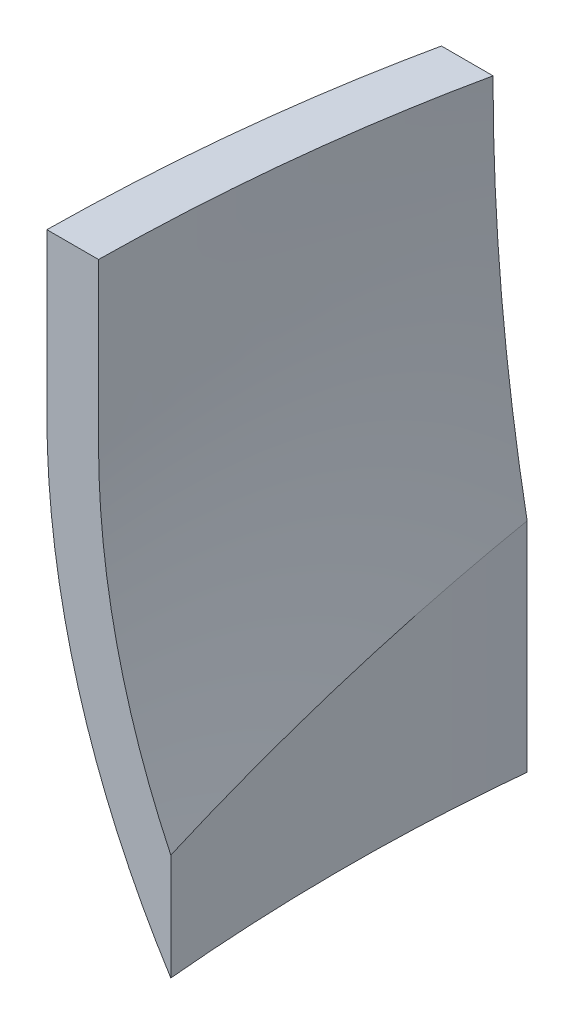
ISO-10303-21;
HEADER;
FILE_DESCRIPTION(('STEP AP214'),'2;1');
FILE_NAME('part.step','',(''),(''),'','','');
FILE_SCHEMA(('AUTOMOTIVE_DESIGN { 1 0 10303 214 1 1 1 1 }'));
ENDSEC;
DATA;
#1=APPLICATION_CONTEXT('core data for automotive mechanical design processes');
#2=APPLICATION_PROTOCOL_DEFINITION('international standard','automotive_design',2000,#1);
#3=PRODUCT_CONTEXT('',#1,'mechanical');
#4=PRODUCT('Part','Part','',(#3));
#5=PRODUCT_RELATED_PRODUCT_CATEGORY('part','',(#4));
#6=PRODUCT_DEFINITION_FORMATION('','',#4);
#7=PRODUCT_DEFINITION_CONTEXT('part definition',#1,'design');
#8=PRODUCT_DEFINITION('design','',#6,#7);
#9=PRODUCT_DEFINITION_SHAPE('','',#8);
#10=(LENGTH_UNIT() NAMED_UNIT(*) SI_UNIT(.MILLI.,.METRE.));
#11=(NAMED_UNIT(*) PLANE_ANGLE_UNIT() SI_UNIT($,.RADIAN.));
#12=(NAMED_UNIT(*) SI_UNIT($,.STERADIAN.) SOLID_ANGLE_UNIT());
#13=UNCERTAINTY_MEASURE_WITH_UNIT(LENGTH_MEASURE(1.E-05),#10,'distance_accuracy_value','');
#14=(GEOMETRIC_REPRESENTATION_CONTEXT(3) GLOBAL_UNCERTAINTY_ASSIGNED_CONTEXT((#13)) GLOBAL_UNIT_ASSIGNED_CONTEXT((#10,
#11,#12)) REPRESENTATION_CONTEXT('',''));
#15=CARTESIAN_POINT('',(0.,0.,0.));
#16=DIRECTION('',(0.,0.,1.));
#17=DIRECTION('',(1.,0.,0.));
#18=AXIS2_PLACEMENT_3D('',#15,#16,#17);
#19=CARTESIAN_POINT('',(293.472310864154,43.37710450171,0.));
#20=DIRECTION('',(0.,0.,1.));
#21=DIRECTION('',(1.,0.,0.));
#22=AXIS2_PLACEMENT_3D('',#19,#20,#21);
#23=PLANE('',#22);
#24=CARTESIAN_POINT('',(293.472310864154,43.37710450171,0.));
#25=DIRECTION('',(0.,0.,-1.));
#26=DIRECTION('',(1.,0.,0.));
#27=AXIS2_PLACEMENT_3D('',#24,#25,#26);
#28=CIRCLE('',#27,382.072310864153);
#29=CARTESIAN_POINT('',(-81.9999999999987,-27.3321205216683,0.));
#30=VERTEX_POINT('',#29);
#31=CARTESIAN_POINT('',(-88.5999999999987,43.3771045017101,0.));
#32=VERTEX_POINT('',#31);
#33=EDGE_CURVE('E266',#30,#32,#28,.T.);
#34=ORIENTED_EDGE('',*,*,#33,.F.);
#35=DIRECTION('',(0.,1.,0.));
#36=VECTOR('',#35,1.);
#37=CARTESIAN_POINT('',(-81.9999999999987,-27.3321205216683,0.));
#38=LINE('',#37,#36);
#39=CARTESIAN_POINT('',(-81.9999999999987,-69.4999999999994,0.));
#40=VERTEX_POINT('',#39);
#41=EDGE_CURVE('E486',#40,#30,#38,.T.);
#42=ORIENTED_EDGE('',*,*,#41,.F.);
#43=CARTESIAN_POINT('',(293.472310864154,43.37710450171,0.));
#44=DIRECTION('',(0.,0.,1.));
#45=DIRECTION('',(1.,0.,0.));
#46=AXIS2_PLACEMENT_3D('',#43,#44,#45);
#47=CIRCLE('',#46,392.072310864153);
#48=CARTESIAN_POINT('',(-98.5999999999987,43.37710450171,0.));
#49=VERTEX_POINT('',#48);
#50=EDGE_CURVE('E204',#49,#40,#47,.T.);
#51=ORIENTED_EDGE('',*,*,#50,.F.);
#52=DIRECTION('',(0.,1.,0.));
#53=VECTOR('',#52,1.);
#54=CARTESIAN_POINT('',(-98.5999999999987,44.0000000000006,0.));
#55=LINE('',#54,#53);
#56=CARTESIAN_POINT('',(-98.5999999999987,44.0000000000006,0.));
#57=VERTEX_POINT('',#56);
#58=EDGE_CURVE('E252',#49,#57,#55,.T.);
#59=ORIENTED_EDGE('',*,*,#58,.T.);
#60=DIRECTION('',(-1.,0.,0.));
#61=VECTOR('',#60,1.);
#62=CARTESIAN_POINT('',(293.472310864154,44.0000000000006,0.));
#63=LINE('',#62,#61);
#64=CARTESIAN_POINT('',(-88.5999999999987,44.0000000000006,0.));
#65=VERTEX_POINT('',#64);
#66=EDGE_CURVE('E188',#65,#57,#63,.T.);
#67=ORIENTED_EDGE('',*,*,#66,.F.);
#68=DIRECTION('',(0.,1.,0.));
#69=VECTOR('',#68,1.);
#70=CARTESIAN_POINT('',(-88.5999999999987,44.0000000000006,0.));
#71=LINE('',#70,#69);
#72=EDGE_CURVE('E15',#32,#65,#71,.T.);
#73=ORIENTED_EDGE('',*,*,#72,.F.);
#74=EDGE_LOOP('',(#34,#42,#51,#59,#67,#73));
#75=FACE_BOUND('',#74,.T.);
#76=ADVANCED_FACE('F177',(#75),#23,.F.);
#77=CARTESIAN_POINT('',(47.7968750004928,13.0000000000125,69.0000000000018));
#78=DIRECTION('',(0.,0.,-1.));
#79=DIRECTION('',(-1.,0.,0.));
#80=AXIS2_PLACEMENT_3D('',#77,#78,#79);
#81=PLANE('',#80);
#82=DIRECTION('',(-4.95750394141011E-12,1.,0.));
#83=VECTOR('',#82,1.);
#84=CARTESIAN_POINT('',(-105.999999999724,43.9999999999975,69.0000000000018));
#85=LINE('',#84,#83);
#86=CARTESIAN_POINT('',(-105.99999999957,12.9999999999975,69.0000000000018));
#87=VERTEX_POINT('',#86);
#88=CARTESIAN_POINT('',(-105.999999999724,43.9999999999975,69.0000000000018));
#89=VERTEX_POINT('',#88);
#90=EDGE_CURVE('E245',#87,#89,#85,.T.);
#91=ORIENTED_EDGE('',*,*,#90,.F.);
#92=CARTESIAN_POINT('',(47.7968750004928,13.0000000000125,69.0000000000018));
#93=DIRECTION('',(0.,0.,-1.));
#94=DIRECTION('',(-1.,0.,0.));
#95=AXIS2_PLACEMENT_3D('',#92,#93,#94);
#96=CIRCLE('',#95,153.796875000062);
#97=CARTESIAN_POINT('',(-81.9999999995703,-69.5000000000042,69.0000000000018));
#98=VERTEX_POINT('',#97);
#99=EDGE_CURVE('E260',#98,#87,#96,.T.);
#100=ORIENTED_EDGE('',*,*,#99,.F.);
#101=DIRECTION('',(2.08087886916519E-11,-1.,0.));
#102=VECTOR('',#101,1.);
#103=CARTESIAN_POINT('',(-81.9999999995699,-69.500000000004,69.0000000000018));
#104=LINE('',#103,#102);
#105=CARTESIAN_POINT('',(-81.9999999999988,-48.8895184978859,69.0000000000018));
#106=VERTEX_POINT('',#105);
#107=EDGE_CURVE('E374',#106,#98,#104,.T.);
#108=ORIENTED_EDGE('',*,*,#107,.F.);
#109=CARTESIAN_POINT('',(47.7968750004928,13.0000000000125,69.0000000000018));
#110=DIRECTION('',(0.,0.,1.));
#111=DIRECTION('',(-1.,0.,0.));
#112=AXIS2_PLACEMENT_3D('',#109,#110,#111);
#113=CIRCLE('',#112,143.796875000277);
#114=CARTESIAN_POINT('',(-95.9999999999453,13.0000000002962,69.0000000000018));
#115=VERTEX_POINT('',#114);
#116=EDGE_CURVE('E365',#115,#106,#113,.T.);
#117=ORIENTED_EDGE('',*,*,#116,.F.);
#118=DIRECTION('',(0.,-1.,0.));
#119=VECTOR('',#118,1.);
#120=CARTESIAN_POINT('',(-95.9999999999987,33.9999999999975,69.0000000000018));
#121=LINE('',#120,#119);
#122=CARTESIAN_POINT('',(-95.9999999999987,33.9999999988572,69.0000000000018));
#123=VERTEX_POINT('',#122);
#124=EDGE_CURVE('E357',#123,#115,#121,.T.);
#125=ORIENTED_EDGE('',*,*,#124,.F.);
#126=DIRECTION('',(0.,-1.,0.));
#127=VECTOR('',#126,1.);
#128=CARTESIAN_POINT('',(-95.9999999999987,43.9999999999975,69.0000000000018));
#129=LINE('',#128,#127);
#130=CARTESIAN_POINT('',(-95.9999999999987,43.9999999999975,69.0000000000018));
#131=VERTEX_POINT('',#130);
#132=EDGE_CURVE('E248',#131,#123,#129,.T.);
#133=ORIENTED_EDGE('',*,*,#132,.F.);
#134=DIRECTION('',(1.,0.,0.));
#135=VECTOR('',#134,1.);
#136=CARTESIAN_POINT('',(47.7968750004928,43.9999999999975,69.0000000000018));
#137=LINE('',#136,#135);
#138=EDGE_CURVE('E241',#89,#131,#137,.T.);
#139=ORIENTED_EDGE('',*,*,#138,.F.);
#140=EDGE_LOOP('',(#91,#100,#108,#117,#125,#133,#139));
#141=FACE_BOUND('',#140,.T.);
#142=ADVANCED_FACE('F243',(#141),#81,.F.);
#143=CARTESIAN_POINT('',(-81.9999999995703,-69.5000000000042,69.0000000000018));
#144=CARTESIAN_POINT('',(-84.1908103200391,-69.5000000000026,45.241721401937));
#145=CARTESIAN_POINT('',(-84.2631564827319,-69.500000000001,22.1008436879174));
#146=CARTESIAN_POINT('',(-81.9999999999987,-69.4999999999994,0.));
#147=CARTESIAN_POINT('',(-85.6689657134802,-63.7276329194251,69.0000000000018));
#148=CARTESIAN_POINT('',(-87.5916872120858,-62.475394429924,45.241721401937));
#149=CARTESIAN_POINT('',(-87.3959445529155,-61.2231559404229,22.1008436879174));
#150=CARTESIAN_POINT('',(-84.8646992483191,-59.9709174509218,0.));
#151=CARTESIAN_POINT('',(-92.199240831058,-51.7628209844033,69.0000000000017));
#152=CARTESIAN_POINT('',(-93.6452289868945,-47.9536031292892,45.241721401937));
#153=CARTESIAN_POINT('',(-92.972752984955,-44.1443852741752,22.1008436879173));
#154=CARTESIAN_POINT('',(-89.9647743375895,-40.3351674190612,0.));
#155=CARTESIAN_POINT('',(-98.4136459689345,-35.6135344487323,69.0000000000018));
#156=CARTESIAN_POINT('',(-99.2499345390836,-28.9519178407417,45.241721401937));
#157=CARTESIAN_POINT('',(-97.9677589514568,-22.290301232751,22.1008436879174));
#158=CARTESIAN_POINT('',(-94.350080718404,-15.6286846247604,0.));
#159=CARTESIAN_POINT('',(-102.141988434971,-21.8056858802479,69.0000000000018));
#160=CARTESIAN_POINT('',(-102.502180392754,-13.3774625341844,45.241721401937));
#161=CARTESIAN_POINT('',(-100.743908192761,-4.94923918812084,22.1008436879174));
#162=CARTESIAN_POINT('',(-96.6501333473424,3.47898415794269,0.));
#163=CARTESIAN_POINT('',(-104.266600538542,-10.9299496511044,69.0000000000018));
#164=CARTESIAN_POINT('',(-104.307266006238,-1.49616436878978,45.241721401937));
#165=CARTESIAN_POINT('',(-102.229467316158,7.93762091352483,22.1008436879173));
#166=CARTESIAN_POINT('',(-97.8161659806517,17.3714061958395,0.));
#167=CARTESIAN_POINT('',(-105.64955206799,0.564216099308913,69.0000000000018));
#168=CARTESIAN_POINT('',(-105.446605423996,10.6147866868206,45.241721401937));
#169=CARTESIAN_POINT('',(-103.125194622225,20.6653572743322,22.1008436879174));
#170=CARTESIAN_POINT('',(-98.4682811750285,30.7159278618439,0.));
#171=CARTESIAN_POINT('',(-105.999999999569,8.74115216883132,69.0000000000018));
#172=CARTESIAN_POINT('',(-105.724143653372,18.9024163664831,45.241721401937));
#173=CARTESIAN_POINT('',(-103.329823149398,29.0636805641349,22.1008436879174));
#174=CARTESIAN_POINT('',(-98.5999999999987,39.2249447617867,0.));
#175=CARTESIAN_POINT('',(-105.99999999957,13.0413180863678,69.0000000000018));
#176=CARTESIAN_POINT('',(-105.724143653372,23.1666745680337,45.241721401937));
#177=CARTESIAN_POINT('',(-103.329823149399,33.2920310496997,22.1008436879174));
#178=CARTESIAN_POINT('',(-98.5999999999987,43.4173875313656,0.));
#179=CARTESIAN_POINT('',(-105.99999999957,13.1037546215268,69.0000000000018));
#180=CARTESIAN_POINT('',(-105.724143653372,23.1964742197901,45.241721401937));
#181=CARTESIAN_POINT('',(-103.329823149399,33.2891938180534,22.1008436879174));
#182=CARTESIAN_POINT('',(-98.5999999999987,43.3819134163167,0.));
#183=CARTESIAN_POINT('',(-105.999999999571,13.1774382592689,69.0000000000018));
#184=CARTESIAN_POINT('',(-105.724143653373,23.2596541388195,45.241721401937));
#185=CARTESIAN_POINT('',(-103.329823149399,33.3418700183701,22.1008436879174));
#186=CARTESIAN_POINT('',(-98.5999999999987,43.4240858979207,0.));
#187=CARTESIAN_POINT('',(-105.999999999571,13.2144949631804,69.0000000000018));
#188=CARTESIAN_POINT('',(-105.724143653373,23.2798616774904,45.241721401937));
#189=CARTESIAN_POINT('',(-103.329823149399,33.3452283918004,22.1008436879174));
#190=CARTESIAN_POINT('',(-98.5999999999987,43.4105951061104,0.));
#191=CARTESIAN_POINT('',(-105.999999999571,13.2357322799548,69.0000000000018));
#192=CARTESIAN_POINT('',(-105.724143653373,23.2974803503089,45.241721401937));
#193=CARTESIAN_POINT('',(-103.329823149399,33.3592284206629,22.1008436879174));
#194=CARTESIAN_POINT('',(-98.5999999999987,43.420976491017,0.));
#195=CARTESIAN_POINT('',(-105.999999999571,13.2676506433478,69.0000000000018));
#196=CARTESIAN_POINT('',(-105.724143653373,23.3180724300584,45.241721401937));
#197=CARTESIAN_POINT('',(-103.329823149399,33.368494216769,22.1008436879174));
#198=CARTESIAN_POINT('',(-98.5999999999987,43.4189160034795,0.));
#199=CARTESIAN_POINT('',(-105.999999999571,13.3157633849377,69.0000000000018));
#200=CARTESIAN_POINT('',(-105.724143653373,23.3531664944067,45.241721401937));
#201=CARTESIAN_POINT('',(-103.329823149399,33.3905696038758,22.1008436879174));
#202=CARTESIAN_POINT('',(-98.5999999999987,43.4279727133449,0.));
#203=CARTESIAN_POINT('',(-105.999999999572,13.3696489360882,69.0000000000018));
#204=CARTESIAN_POINT('',(-105.724143653373,23.3895453193955,45.241721401937));
#205=CARTESIAN_POINT('',(-103.329823149399,33.4094417027027,22.1008436879174));
#206=CARTESIAN_POINT('',(-98.5999999999988,43.42933808601,0.));
#207=CARTESIAN_POINT('',(-105.999999999572,13.4130188400023,69.0000000000018));
#208=CARTESIAN_POINT('',(-105.724143653373,23.4199750379318,45.241721401937));
#209=CARTESIAN_POINT('',(-103.329823149399,33.4269312358612,22.1008436879173));
#210=CARTESIAN_POINT('',(-98.5999999999986,43.4338874337907,0.));
#211=CARTESIAN_POINT('',(-105.999999999572,13.4456783227756,69.0000000000018));
#212=CARTESIAN_POINT('',(-105.724143653374,23.4423541082036,45.241721401937));
#213=CARTESIAN_POINT('',(-103.329823149399,33.4390298936316,22.1008436879173));
#214=CARTESIAN_POINT('',(-98.5999999999988,43.4357056790597,0.));
#215=CARTESIAN_POINT('',(-105.999999999572,13.4784711837275,69.0000000000018));
#216=CARTESIAN_POINT('',(-105.724143653374,23.4650625139528,45.241721401937));
#217=CARTESIAN_POINT('',(-103.329823149399,33.4516538441781,22.1008436879173));
#218=CARTESIAN_POINT('',(-98.5999999999985,43.4382451744033,0.));
#219=CARTESIAN_POINT('',(-105.999999999572,13.5031668555812,69.0000000000018));
#220=CARTESIAN_POINT('',(-105.724143653374,23.4820301354838,45.241721401937));
#221=CARTESIAN_POINT('',(-103.329823149399,33.4608934153863,22.1008436879173));
#222=CARTESIAN_POINT('',(-98.5999999999989,43.4397566952889,0.));
#223=CARTESIAN_POINT('',(-105.999999999572,13.519673144586,69.0000000000018));
#224=CARTESIAN_POINT('',(-105.724143653374,23.493424509904,45.241721401937));
#225=CARTESIAN_POINT('',(-103.329823149399,33.467175875222,22.1008436879173));
#226=CARTESIAN_POINT('',(-98.5999999999986,43.44092724054,0.));
#227=CARTESIAN_POINT('',(-105.999999999572,13.5279348113194,69.0000000000018));
#228=CARTESIAN_POINT('',(-105.724143653374,23.4990986055526,45.241721401937));
#229=CARTESIAN_POINT('',(-103.329823149399,33.4702623997859,22.1008436879173));
#230=CARTESIAN_POINT('',(-98.5999999999987,43.4414261940192,0.));
#231=CARTESIAN_POINT('',(-105.999999999572,13.5362050209609,69.0000000000018));
#232=CARTESIAN_POINT('',(-105.724143653374,23.5047997287603,45.241721401937));
#233=CARTESIAN_POINT('',(-103.329823149399,33.4733944365596,22.1008436879173));
#234=CARTESIAN_POINT('',(-98.5999999999987,43.4419891443589,0.));
#235=CARTESIAN_POINT('',(-105.999999999573,13.5444837941878,69.0000000000018));
#236=CARTESIAN_POINT('',(-105.724143653374,23.5104922178391,45.241721401937));
#237=CARTESIAN_POINT('',(-103.329823149399,33.4765006414904,22.1008436879173));
#238=CARTESIAN_POINT('',(-98.5999999999988,43.4425090651417,0.));
#239=CARTESIAN_POINT('',(-105.999999999573,13.5527711516773,69.0000000000018));
#240=CARTESIAN_POINT('',(-105.724143653374,23.5161964206278,45.241721401937));
#241=CARTESIAN_POINT('',(-103.329823149399,33.4796216895783,22.1008436879173));
#242=CARTESIAN_POINT('',(-98.5999999999986,43.4430469585288,0.));
#243=CARTESIAN_POINT('',(-105.999999999573,13.5610671141064,69.0000000000018));
#244=CARTESIAN_POINT('',(-105.724143653374,23.5219013306976,45.241721401937));
#245=CARTESIAN_POINT('',(-103.329823149399,33.4827355472887,22.1008436879173));
#246=CARTESIAN_POINT('',(-98.5999999999989,43.4435697638799,0.));
#247=CARTESIAN_POINT('',(-105.999999999573,13.5693717021524,69.0000000000018));
#248=CARTESIAN_POINT('',(-105.724143653374,23.527612936301,45.241721401937));
#249=CARTESIAN_POINT('',(-103.329823149399,33.4858541704495,22.1008436879174));
#250=CARTESIAN_POINT('',(-98.5999999999986,43.444095404598,0.));
#251=CARTESIAN_POINT('',(-105.999999999573,13.5776849364926,69.0000000000018));
#252=CARTESIAN_POINT('',(-105.724143653374,23.5333280781905,45.241721401937));
#253=CARTESIAN_POINT('',(-103.329823149399,33.4889712198883,22.1008436879174));
#254=CARTESIAN_POINT('',(-98.5999999999987,43.4446143615862,0.));
#255=CARTESIAN_POINT('',(-105.999999999573,13.5860068378042,69.0000000000018));
#256=CARTESIAN_POINT('',(-105.724143653374,23.5390485101105,45.241721401937));
#257=CARTESIAN_POINT('',(-103.329823149399,33.4920901824168,22.1008436879174));
#258=CARTESIAN_POINT('',(-98.5999999999987,43.4451318547231,0.));
#259=CARTESIAN_POINT('',(-105.999999999573,13.5943374267644,69.0000000000018));
#260=CARTESIAN_POINT('',(-105.724143653374,23.5447733470122,45.241721401937));
#261=CARTESIAN_POINT('',(-103.329823149399,33.4952092672601,22.1008436879174));
#262=CARTESIAN_POINT('',(-98.5999999999986,43.445645187508,0.));
#263=CARTESIAN_POINT('',(-105.999999999573,13.6026767240503,69.0000000000018));
#264=CARTESIAN_POINT('',(-105.724143653374,23.5505031179613,45.241721401937));
#265=CARTESIAN_POINT('',(-103.3298231494,33.4983295118723,22.1008436879174));
#266=CARTESIAN_POINT('',(-98.5999999999988,43.4461559057834,0.));
#267=CARTESIAN_POINT('',(-105.999999999573,13.6110247503395,69.0000000000018));
#268=CARTESIAN_POINT('',(-105.724143653374,23.5562375945782,45.241721401937));
#269=CARTESIAN_POINT('',(-103.329823149399,33.501450438817,22.1008436879174));
#270=CARTESIAN_POINT('',(-98.5999999999986,43.4466632830557,0.));
#271=CARTESIAN_POINT('',(-105.999999999573,13.6193815263089,69.0000000000018));
#272=CARTESIAN_POINT('',(-105.724143653374,23.5619769487229,45.241721401937));
#273=CARTESIAN_POINT('',(-103.3298231494,33.5045723711369,22.1008436879174));
#274=CARTESIAN_POINT('',(-98.5999999999988,43.4471677935509,0.));
#275=CARTESIAN_POINT('',(-105.999999999573,13.6305355880779,69.0000000000018));
#276=CARTESIAN_POINT('',(-105.724143653374,23.5696358780609,45.241721401937));
#277=CARTESIAN_POINT('',(-103.329823149399,33.5087361680439,22.1008436879174));
#278=CARTESIAN_POINT('',(-98.5999999999986,43.4478364580269,0.));
#279=CARTESIAN_POINT('',(-105.999999999573,13.641707231916,69.0000000000018));
#280=CARTESIAN_POINT('',(-105.724143653374,23.5773046146135,45.241721401937));
#281=CARTESIAN_POINT('',(-103.3298231494,33.512901997311,22.1008436879174));
#282=CARTESIAN_POINT('',(-98.5999999999988,43.4484993800084,0.));
#283=CARTESIAN_POINT('',(-105.999999999573,13.6528965405322,69.0000000000018));
#284=CARTESIAN_POINT('',(-105.724143653374,23.5849832654169,45.241721401937));
#285=CARTESIAN_POINT('',(-103.3298231494,33.5170699903017,22.1008436879174));
#286=CARTESIAN_POINT('',(-98.5999999999987,43.4491567151864,0.));
#287=CARTESIAN_POINT('',(-105.999999999573,13.6612973750605,69.0000000000018));
#288=CARTESIAN_POINT('',(-105.724143653374,23.5907472485892,45.241721401937));
#289=CARTESIAN_POINT('',(-103.3298231494,33.5201971221179,22.1008436879174));
#290=CARTESIAN_POINT('',(-98.5999999999989,43.4496469956466,0.));
#291=CARTESIAN_POINT('',(-105.999999999573,13.6697070833322,69.0000000000018));
#292=CARTESIAN_POINT('',(-105.724143653374,23.5965162521717,45.241721401937));
#293=CARTESIAN_POINT('',(-103.329823149399,33.5233254210113,22.1008436879174));
#294=CARTESIAN_POINT('',(-98.5999999999985,43.4501345898509,0.));
#295=CARTESIAN_POINT('',(-105.999999999573,13.6781256860245,69.0000000000018));
#296=CARTESIAN_POINT('',(-105.724143653374,23.6022903092631,45.241721401937));
#297=CARTESIAN_POINT('',(-103.3298231494,33.5264549325018,22.1008436879173));
#298=CARTESIAN_POINT('',(-98.5999999999989,43.4506195557404,0.));
#299=CARTESIAN_POINT('',(-105.999999999573,13.6865532038145,69.0000000000018));
#300=CARTESIAN_POINT('',(-105.724143653374,23.608069447825,45.241721401937));
#301=CARTESIAN_POINT('',(-103.3298231494,33.5295856918354,22.1008436879173));
#302=CARTESIAN_POINT('',(-98.5999999999987,43.4511019358458,0.));
#303=CARTESIAN_POINT('',(-105.999999999573,13.6949896573794,69.0000000000018));
#304=CARTESIAN_POINT('',(-105.724143653374,23.6138536976359,45.241721401937));
#305=CARTESIAN_POINT('',(-103.3298231494,33.5327177378924,22.1008436879173));
#306=CARTESIAN_POINT('',(-98.5999999999987,43.4515817781489,0.));
#307=CARTESIAN_POINT('',(-105.999999999573,13.7034350673964,69.0000000000018));
#308=CARTESIAN_POINT('',(-105.724143653374,23.6196430873025,45.241721401937));
#309=CARTESIAN_POINT('',(-103.3298231494,33.5358511072087,22.1008436879173));
#310=CARTESIAN_POINT('',(-98.5999999999987,43.4520591271148,0.));
#311=CARTESIAN_POINT('',(-105.999999999573,13.7118894545428,69.0000000000018));
#312=CARTESIAN_POINT('',(-105.724143653374,23.6254376444716,45.241721401937));
#313=CARTESIAN_POINT('',(-103.3298231494,33.5389858344003,22.1008436879173));
#314=CARTESIAN_POINT('',(-98.5999999999988,43.452534024329,0.));
#315=CARTESIAN_POINT('',(-105.999999999573,13.7203528394958,69.0000000000018));
#316=CARTESIAN_POINT('',(-105.724143653374,23.6312373983481,45.241721401937));
#317=CARTESIAN_POINT('',(-103.3298231494,33.5421219572004,22.1008436879173));
#318=CARTESIAN_POINT('',(-98.5999999999987,43.4530065160528,0.));
#319=CARTESIAN_POINT('',(-105.999999999573,13.7316493774117,69.0000000000017));
#320=CARTESIAN_POINT('',(-105.724143653375,23.6389773658781,45.241721401937));
#321=CARTESIAN_POINT('',(-103.3298231494,33.5463053543446,22.1008436879173));
#322=CARTESIAN_POINT('',(-98.5999999999988,43.4536333428111,0.));
#323=CARTESIAN_POINT('',(-105.999999999574,13.7514499558281,69.0000000000018));
#324=CARTESIAN_POINT('',(-105.724143653375,23.652540689064,45.241721401937));
#325=CARTESIAN_POINT('',(-103.3298231494,33.5536314223,22.1008436879173));
#326=CARTESIAN_POINT('',(-98.5999999999987,43.4547221555359,0.));
#327=CARTESIAN_POINT('',(-105.999999999574,13.7911782398767,69.0000000000018));
#328=CARTESIAN_POINT('',(-105.724143653375,23.6797415734216,45.241721401937));
#329=CARTESIAN_POINT('',(-103.3298231494,33.5683049069666,22.1008436879173));
#330=CARTESIAN_POINT('',(-98.5999999999987,43.4568682405115,0.));
#331=CARTESIAN_POINT('',(-105.999999999574,13.8482994603429,69.0000000000018));
#332=CARTESIAN_POINT('',(-105.724143653375,23.7188162472444,45.241721401937));
#333=CARTESIAN_POINT('',(-103.3298231494,33.589333034146,22.1008436879173));
#334=CARTESIAN_POINT('',(-98.5999999999989,43.4598498210475,0.));
#335=CARTESIAN_POINT('',(-105.999999999574,13.9059182083724,69.0000000000018));
#336=CARTESIAN_POINT('',(-105.724143653375,23.7581894573905,45.241721401937));
#337=CARTESIAN_POINT('',(-103.3298231494,33.6104607064085,22.1008436879173));
#338=CARTESIAN_POINT('',(-98.5999999999985,43.4627319554265,0.));
#339=CARTESIAN_POINT('',(-105.999999999575,13.9523170166975,69.0000000000018));
#340=CARTESIAN_POINT('',(-105.724143653375,23.7898727886284,45.241721401937));
#341=CARTESIAN_POINT('',(-103.3298231494,33.6274285605593,22.1008436879173));
#342=CARTESIAN_POINT('',(-98.5999999999989,43.4649843324903,0.));
#343=CARTESIAN_POINT('',(-105.999999999575,13.9814439621434,69.0000000000018));
#344=CARTESIAN_POINT('',(-105.724143653375,23.8097529655777,45.241721401937));
#345=CARTESIAN_POINT('',(-103.3298231494,33.6380619690119,22.1008436879173));
#346=CARTESIAN_POINT('',(-98.5999999999986,43.4663709724461,0.));
#347=CARTESIAN_POINT('',(-105.999999999575,14.0048227943164,69.0000000000018));
#348=CARTESIAN_POINT('',(-105.724143653375,23.8257046230106,45.241721401937));
#349=CARTESIAN_POINT('',(-103.3298231494,33.6465864517048,22.1008436879173));
#350=CARTESIAN_POINT('',(-98.5999999999987,43.4674682803991,0.));
#351=CARTESIAN_POINT('',(-105.999999999575,14.0282533642572,69.0000000000018));
#352=CARTESIAN_POINT('',(-105.724143653376,23.8416881670366,45.241721401937));
#353=CARTESIAN_POINT('',(-103.3298231494,33.6551229698161,22.1008436879173));
#354=CARTESIAN_POINT('',(-98.5999999999988,43.4685577725956,0.));
#355=CARTESIAN_POINT('',(-105.999999999575,14.0517618716849,69.0000000000018));
#356=CARTESIAN_POINT('',(-105.724143653376,23.8577198627518,45.241721401937));
#357=CARTESIAN_POINT('',(-103.3298231494,33.6636778538187,22.1008436879173));
#358=CARTESIAN_POINT('',(-98.5999999999986,43.4696358448856,0.));
#359=CARTESIAN_POINT('',(-105.999999999575,14.0753489782697,69.0000000000018));
#360=CARTESIAN_POINT('',(-105.724143653376,23.8738003296083,45.241721401937));
#361=CARTESIAN_POINT('',(-103.3298231494,33.6722516809468,22.1008436879173));
#362=CARTESIAN_POINT('',(-98.5999999999988,43.4707030322854,0.));
#363=CARTESIAN_POINT('',(-105.999999999575,14.0989887048492,69.0000000000017));
#364=CARTESIAN_POINT('',(-105.724143653376,23.8899135158771,45.241721401937));
#365=CARTESIAN_POINT('',(-103.3298231494,33.6808383269049,22.1008436879173));
#366=CARTESIAN_POINT('',(-98.5999999999986,43.4717631379328,0.));
#367=CARTESIAN_POINT('',(-105.999999999575,14.1227076922559,69.0000000000017));
#368=CARTESIAN_POINT('',(-105.724143653376,23.9060760795153,45.241721401937));
#369=CARTESIAN_POINT('',(-103.3298231494,33.6894444667746,22.1008436879173));
#370=CARTESIAN_POINT('',(-98.5999999999989,43.472812854034,0.));
#371=CARTESIAN_POINT('',(-105.999999999576,14.1465066021606,69.0000000000017));
#372=CARTESIAN_POINT('',(-105.724143653376,23.922288625378,45.241721401937));
#373=CARTESIAN_POINT('',(-103.3298231494,33.6980706485954,22.1008436879173));
#374=CARTESIAN_POINT('',(-98.5999999999986,43.4738526718128,0.));
#375=CARTESIAN_POINT('',(-105.999999999576,14.1643959112559,69.0000000000017));
#376=CARTESIAN_POINT('',(-105.724143653376,23.9344731610669,45.241721401937));
#377=CARTESIAN_POINT('',(-103.3298231494,33.7045504108778,22.1008436879173));
#378=CARTESIAN_POINT('',(-98.5999999999988,43.4746276606888,0.));
#379=CARTESIAN_POINT('',(-105.999999999576,14.1823255124356,69.0000000000017));
#380=CARTESIAN_POINT('',(-105.724143653376,23.9466829929436,45.241721401937));
#381=CARTESIAN_POINT('',(-103.3298231494,33.7110404734517,22.1008436879173));
#382=CARTESIAN_POINT('',(-98.5999999999986,43.4753979539597,0.));
#383=CARTESIAN_POINT('',(-105.999999999576,14.2422257080401,69.0000000000017));
#384=CARTESIAN_POINT('',(-105.724143653376,23.9874671233468,45.241721401937));
#385=CARTESIAN_POINT('',(-103.329823149401,33.7327085386535,22.1008436879173));
#386=CARTESIAN_POINT('',(-98.5999999999989,43.4779499539602,0.));
#387=CARTESIAN_POINT('',(-105.999999999576,14.3450919250128,69.0000000000017));
#388=CARTESIAN_POINT('',(-105.724143653376,24.0574523160377,45.241721401937));
#389=CARTESIAN_POINT('',(-103.3298231494,33.7698127070625,22.1008436879173));
#390=CARTESIAN_POINT('',(-98.5999999999984,43.4821730980873,0.));
#391=CARTESIAN_POINT('',(-105.999999999577,14.4929993802202,69.0000000000017));
#392=CARTESIAN_POINT('',(-105.724143653377,24.1579625560638,45.241721401937));
#393=CARTESIAN_POINT('',(-103.329823149401,33.8229257319073,22.1008436879173));
#394=CARTESIAN_POINT('',(-98.5999999999991,43.4878889077509,0.));
#395=CARTESIAN_POINT('',(-105.999999999578,14.6436760899007,69.0000000000017));
#396=CARTESIAN_POINT('',(-105.724143653377,24.2602481412049,45.241721401937));
#397=CARTESIAN_POINT('',(-103.329823149401,33.8768201925091,22.1008436879173));
#398=CARTESIAN_POINT('',(-98.5999999999984,43.4933922438133,0.));
#399=CARTESIAN_POINT('',(-105.999999999579,14.7972067478699,69.0000000000017));
#400=CARTESIAN_POINT('',(-105.724143653378,24.3643744970344,45.241721401937));
#401=CARTESIAN_POINT('',(-103.329823149402,33.9315422461988,22.1008436879173));
#402=CARTESIAN_POINT('',(-98.5999999999991,43.4987099953633,0.));
#403=CARTESIAN_POINT('',(-105.99999999958,14.9536760479435,69.0000000000017));
#404=CARTESIAN_POINT('',(-105.724143653378,24.470405358764,45.241721401937));
#405=CARTESIAN_POINT('',(-103.329823149402,33.9871346695846,22.1008436879173));
#406=CARTESIAN_POINT('',(-98.5999999999986,43.5038639804051,0.));
#407=CARTESIAN_POINT('',(-105.99999999958,15.1131686839368,69.0000000000017));
#408=CARTESIAN_POINT('',(-105.724143653379,24.578403248305,45.241721401937));
#409=CARTESIAN_POINT('',(-103.329823149402,34.0436378126732,22.1008436879173));
#410=CARTESIAN_POINT('',(-98.5999999999988,43.5088723770415,0.));
#411=CARTESIAN_POINT('',(-105.999999999581,15.3299695715743,69.0000000000017));
#412=CARTESIAN_POINT('',(-105.72414365338,24.725105023834,45.241721401937));
#413=CARTESIAN_POINT('',(-103.329823149402,34.1202404760936,22.1008436879173));
#414=CARTESIAN_POINT('',(-98.5999999999987,43.5153759283533,0.));
#415=CARTESIAN_POINT('',(-105.999999999583,15.6089524899966,69.0000000000017));
#416=CARTESIAN_POINT('',(-105.724143653381,24.9137055455494,45.241721401937));
#417=CARTESIAN_POINT('',(-103.329823149403,34.2184586011021,22.1008436879173));
#418=CARTESIAN_POINT('',(-98.5999999999986,43.5232116566548,0.));
#419=CARTESIAN_POINT('',(-105.999999999585,16.0732564191035,69.0000000000017));
#420=CARTESIAN_POINT('',(-105.724143653382,25.2272482424501,45.241721401937));
#421=CARTESIAN_POINT('',(-103.329823149404,34.3812400657967,22.1008436879173));
#422=CARTESIAN_POINT('',(-98.5999999999989,43.5352318891433,0.));
#423=CARTESIAN_POINT('',(-105.999999999588,16.6889513186028,69.0000000000017));
#424=CARTESIAN_POINT('',(-105.724143653384,25.6424480853369,45.241721401937));
#425=CARTESIAN_POINT('',(-103.329823149405,34.595944852071,22.1008436879173));
#426=CARTESIAN_POINT('',(-98.5999999999986,43.5494416188051,0.));
#427=CARTESIAN_POINT('',(-105.999999999592,17.4897095831704,69.0000000000017));
#428=CARTESIAN_POINT('',(-105.724143653387,26.1816573581205,45.241721401937));
#429=CARTESIAN_POINT('',(-103.329823149406,34.8736051330707,22.1008436879173));
#430=CARTESIAN_POINT('',(-98.5999999999987,43.5655529080208,0.));
#431=CARTESIAN_POINT('',(-105.999999999598,18.6471803217289,69.0000000000017));
#432=CARTESIAN_POINT('',(-105.724143653391,26.9601372007728,45.241721401937));
#433=CARTESIAN_POINT('',(-103.329823149408,35.2730940798166,22.1008436879173));
#434=CARTESIAN_POINT('',(-98.5999999999988,43.5860509588604,0.));
#435=CARTESIAN_POINT('',(-105.999999999606,20.2759317287628,69.0000000000018));
#436=CARTESIAN_POINT('',(-105.724143653396,28.0540557366024,45.241721401937));
#437=CARTESIAN_POINT('',(-103.32982314941,35.832179744442,22.1008436879173));
#438=CARTESIAN_POINT('',(-98.5999999999986,43.6103037522816,0.));
#439=CARTESIAN_POINT('',(-105.99999999962,23.1679685287858,69.0000000000018));
#440=CARTESIAN_POINT('',(-105.724143653406,29.9943981261083,45.241721401937));
#441=CARTESIAN_POINT('',(-103.329823149415,36.8208277234308,22.1008436879174));
#442=CARTESIAN_POINT('',(-98.5999999999989,43.6472573207533,0.));
#443=CARTESIAN_POINT('',(-105.999999999636,26.3359874268429,69.0000000000018));
#444=CARTESIAN_POINT('',(-105.724143653416,32.1182194450981,45.241721401937));
#445=CARTESIAN_POINT('',(-103.32982314942,37.9004514633534,22.1008436879174));
#446=CARTESIAN_POINT('',(-98.5999999999986,43.6826834816088,0.));
#447=CARTESIAN_POINT('',(-105.999999999651,29.4738489726947,69.0000000000018));
#448=CARTESIAN_POINT('',(-105.724143653426,34.2219110256519,45.241721401937));
#449=CARTESIAN_POINT('',(-103.329823149426,38.9699730786091,22.1008436879174));
#450=CARTESIAN_POINT('',(-98.5999999999987,43.7180351315664,0.));
#451=CARTESIAN_POINT('',(-105.999999999663,31.7976054677814,69.0000000000018));
#452=CARTESIAN_POINT('',(-105.724143653434,35.7800954725539,45.241721401937));
#453=CARTESIAN_POINT('',(-103.32982314943,39.7625854773264,22.1008436879174));
#454=CARTESIAN_POINT('',(-98.5999999999987,43.7450754820989,0.));
#455=CARTESIAN_POINT('',(-105.999999999674,34.077161310367,69.0000000000018));
#456=CARTESIAN_POINT('',(-105.724143653442,37.3089590930562,45.241721401937));
#457=CARTESIAN_POINT('',(-103.329823149433,40.5407568757454,22.1008436879174));
#458=CARTESIAN_POINT('',(-98.5999999999987,43.7725546584345,0.));
#459=CARTESIAN_POINT('',(-105.999999999685,36.2979555122519,69.0000000000018));
#460=CARTESIAN_POINT('',(-105.724143653449,38.7993325384986,45.241721401937));
#461=CARTESIAN_POINT('',(-103.329823149437,41.3007095647452,22.1008436879174));
#462=CARTESIAN_POINT('',(-98.5999999999988,43.8020865909919,0.));
#463=CARTESIAN_POINT('',(-105.999999999696,38.4454270852369,69.0000000000018));
#464=CARTESIAN_POINT('',(-105.724143653456,40.2411238866728,45.241721401937));
#465=CARTESIAN_POINT('',(-103.329823149441,42.0368206881086,22.1008436879174));
#466=CARTESIAN_POINT('',(-98.5999999999988,43.8325174895445,0.));
#467=CARTESIAN_POINT('',(-105.999999999704,40.1398466017157,69.0000000000018));
#468=CARTESIAN_POINT('',(-105.724143653462,41.3808766812368,45.241721401937));
#469=CARTESIAN_POINT('',(-103.329823149443,42.6219067607578,22.1008436879174));
#470=CARTESIAN_POINT('',(-98.5999999999986,43.8629368402789,0.));
#471=CARTESIAN_POINT('',(-105.999999999711,41.4178753761382,69.0000000000018));
#472=CARTESIAN_POINT('',(-105.724143653466,42.2411688662112,45.241721401937));
#473=CARTESIAN_POINT('',(-103.329823149445,43.0644623562842,22.1008436879174));
#474=CARTESIAN_POINT('',(-98.5999999999988,43.8877558463572,0.));
#475=CARTESIAN_POINT('',(-105.999999999715,42.3325378470361,69.0000000000018));
#476=CARTESIAN_POINT('',(-105.724143653469,42.8599878941579,45.241721401937));
#477=CARTESIAN_POINT('',(-103.329823149447,43.3874379412796,22.1008436879174));
#478=CARTESIAN_POINT('',(-98.5999999999986,43.9148879884014,0.));
#479=CARTESIAN_POINT('',(-105.999999999719,43.0539525724028,69.0000000000018));
#480=CARTESIAN_POINT('',(-105.724143653471,43.3460832624638,45.241721401937));
#481=CARTESIAN_POINT('',(-103.329823149448,43.6382139525248,22.1008436879174));
#482=CARTESIAN_POINT('',(-98.5999999999987,43.9303446425859,0.));
#483=CARTESIAN_POINT('',(-105.999999999722,43.604049107198,69.0000000000018));
#484=CARTESIAN_POINT('',(-105.724143653473,43.7258494599349,45.241721401937));
#485=CARTESIAN_POINT('',(-103.329823149449,43.8476498126718,22.1008436879174));
#486=CARTESIAN_POINT('',(-98.5999999999987,43.9694501654088,0.));
#487=CARTESIAN_POINT('',(-105.999999999723,43.8696601518848,69.0000000000018));
#488=CARTESIAN_POINT('',(-105.724143653474,43.901849966413,45.241721401937));
#489=CARTESIAN_POINT('',(-103.329823149449,43.9340397809412,22.1008436879174));
#490=CARTESIAN_POINT('',(-98.5999999999987,43.9662295954695,0.));
#491=CARTESIAN_POINT('',(-105.999999999724,43.9999999999975,69.0000000000018));
#492=CARTESIAN_POINT('',(-105.724143653475,43.9999999999985,45.241721401937));
#493=CARTESIAN_POINT('',(-103.32982314945,43.9999999999995,22.1008436879174));
#494=CARTESIAN_POINT('',(-98.5999999999987,44.0000000000006,0.));
#495=B_SPLINE_SURFACE_WITH_KNOTS('',3,3,((#143,#144,#145,#146),(#147,#148,#149,#150),(#151,#152,
#153,#154),(#155,#156,#157,#158),(#159,#160,#161,#162),(#163,#164,#165,#166),(#167,#168,#169,
#170),(#171,#172,#173,#174),(#175,#176,#177,#178),(#179,#180,#181,#182),(#183,#184,#185,#186),
(#187,#188,#189,#190),(#191,#192,#193,#194),(#195,#196,#197,#198),(#199,#200,#201,#202),(#203,
#204,#205,#206),(#207,#208,#209,#210),(#211,#212,#213,#214),(#215,#216,#217,#218),(#219,#220,
#221,#222),(#223,#224,#225,#226),(#227,#228,#229,#230),(#231,#232,#233,#234),(#235,#236,#237,
#238),(#239,#240,#241,#242),(#243,#244,#245,#246),(#247,#248,#249,#250),(#251,#252,#253,#254),
(#255,#256,#257,#258),(#259,#260,#261,#262),(#263,#264,#265,#266),(#267,#268,#269,#270),(#271,
#272,#273,#274),(#275,#276,#277,#278),(#279,#280,#281,#282),(#283,#284,#285,#286),(#287,#288,
#289,#290),(#291,#292,#293,#294),(#295,#296,#297,#298),(#299,#300,#301,#302),(#303,#304,#305,
#306),(#307,#308,#309,#310),(#311,#312,#313,#314),(#315,#316,#317,#318),(#319,#320,#321,#322),
(#323,#324,#325,#326),(#327,#328,#329,#330),(#331,#332,#333,#334),(#335,#336,#337,#338),(#339,
#340,#341,#342),(#343,#344,#345,#346),(#347,#348,#349,#350),(#351,#352,#353,#354),(#355,#356,
#357,#358),(#359,#360,#361,#362),(#363,#364,#365,#366),(#367,#368,#369,#370),(#371,#372,#373,
#374),(#375,#376,#377,#378),(#379,#380,#381,#382),(#383,#384,#385,#386),(#387,#388,#389,#390),
(#391,#392,#393,#394),(#395,#396,#397,#398),(#399,#400,#401,#402),(#403,#404,#405,#406),(#407,
#408,#409,#410),(#411,#412,#413,#414),(#415,#416,#417,#418),(#419,#420,#421,#422),(#423,#424,
#425,#426),(#427,#428,#429,#430),(#431,#432,#433,#434),(#435,#436,#437,#438),(#439,#440,#441,
#442),(#443,#444,#445,#446),(#447,#448,#449,#450),(#451,#452,#453,#454),(#455,#456,#457,#458),
(#459,#460,#461,#462),(#463,#464,#465,#466),(#467,#468,#469,#470),(#471,#472,#473,#474),(#475,
#476,#477,#478),(#479,#480,#481,#482),(#483,#484,#485,#486),(#487,#488,#489,#490),(#491,#492,
#493,#494)),.UNSPECIFIED.,.F.,.F.,.F.,(4,1,1,1,1,1,2,1,1,1,1,1,1,1,1,1,1,1,1,1,1,1,1,1,1,1,1,1,
1,1,1,1,1,1,1,1,1,1,1,1,1,1,1,1,1,1,1,1,1,1,1,1,1,1,1,1,1,1,1,1,1,1,1,1,1,1,1,1,1,1,1,1,1,1,1,1,
1,1,1,1,1,1,1,1,4),(4,4),(0.516899655829828,0.621446257085651,0.725992858341474,
0.778266158969385,0.830539459597297,0.882812760225208,0.93508606085312,0.935593201002704,
0.935846771077496,0.935973556114892,0.93603694863359,0.936100341152288,0.936353911227081,
0.936607481301873,0.936734266339271,0.936861051376666,0.936987836414061,0.937114621451459,
0.937146317710808,0.937178013970158,0.937209710229507,0.937241406488857,0.937273102748206,
0.937304799007555,0.937336495266902,0.937368191526252,0.937399887785601,0.937431584044948,
0.937463280304297,0.937494976563647,0.937526672822996,0.937558369082345,0.937621761601044,
0.937653457860394,0.937685154119743,0.937716850379093,0.937748546638442,0.937780242897791,
0.937811939157141,0.937843635416488,0.937875331675837,0.937907027935186,0.937938724194533,
0.938002116713232,0.93812890175063,0.938382471825422,0.938636041900215,0.938762826937613,
0.938889611975008,0.938953004493704,0.939016397012403,0.939143182049801,0.9392065745685,
0.939269967087198,0.939396752124593,0.939460144643289,0.939523537161988,0.939586929680687,
0.939650322199386,0.940157462348972,0.940664602498557,0.94117174264814,0.941678882797722,
0.942186022947308,0.942693163096893,0.943200303246479,0.94421458354565,0.945228863844821,
0.94725742444316,0.949285985041499,0.95131454563984,0.955371666836519,0.9594287880332,
0.967543030426559,0.971600151623239,0.97565727281992,0.979714394016598,0.98377151521328,
0.98782863640996,0.991885757606638,0.99391431820498,0.995942878803319,0.997971439401658,
0.998985719700829,1.),(0.,1.),.UNSPECIFIED.);
#496=CARTESIAN_POINT('',(-105.999999999724,43.9999999999975,69.0000000000018));
#497=CARTESIAN_POINT('',(-105.724143653475,43.9999999999985,45.241721401937));
#498=CARTESIAN_POINT('',(-103.32982314945,43.9999999999995,22.1008436879174));
#499=CARTESIAN_POINT('',(-98.5999999999987,44.0000000000006,0.));
#500=B_SPLINE_CURVE_WITH_KNOTS('',3,(#496,#497,#498,#499),.UNSPECIFIED.,.F.,.F.,(4,4),(0.,1.),.UNSPECIFIED.);
#501=EDGE_CURVE('E258',#89,#57,#500,.T.);
#502=CARTESIAN_POINT('',(-81.9999999995703,-69.5000000000042,69.0000000000018));
#503=CARTESIAN_POINT('',(-84.1908103200391,-69.5000000000026,45.241721401937));
#504=CARTESIAN_POINT('',(-84.2631564827319,-69.500000000001,22.1008436879174));
#505=CARTESIAN_POINT('',(-81.9999999999987,-69.4999999999994,0.));
#506=B_SPLINE_CURVE_WITH_KNOTS('',3,(#502,#503,#504,#505),.UNSPECIFIED.,.F.,.F.,(4,4),(0.,1.),.UNSPECIFIED.);
#507=EDGE_CURVE('E196',#98,#40,#506,.T.);
#508=ORIENTED_EDGE('',*,*,#99,.T.);
#509=ORIENTED_EDGE('',*,*,#90,.T.);
#510=ORIENTED_EDGE('',*,*,#501,.T.);
#511=ORIENTED_EDGE('',*,*,#58,.F.);
#512=ORIENTED_EDGE('',*,*,#50,.T.);
#513=ORIENTED_EDGE('',*,*,#507,.F.);
#514=EDGE_LOOP('',(#508,#509,#510,#511,#512,#513));
#515=FACE_BOUND('',#514,.T.);
#516=ADVANCED_FACE('F257',(#515),#495,.T.);
#517=CARTESIAN_POINT('',(-81.9999999999988,-48.8895184978859,69.0000000000018));
#518=CARTESIAN_POINT('',(-84.1908103203247,-41.7037191724801,45.241721401937));
#519=CARTESIAN_POINT('',(-84.2631564828748,-34.5179198470742,22.1008436879174));
#520=CARTESIAN_POINT('',(-81.9999999999987,-27.3321205216683,0.));
#521=CARTESIAN_POINT('',(-81.999999999963,-50.6070586230624,69.0000000000018));
#522=CARTESIAN_POINT('',(-84.1908103203009,-44.0200759081069,45.241721401937));
#523=CARTESIAN_POINT('',(-84.2631564828629,-37.4330931931514,22.1008436879174));
#524=CARTESIAN_POINT('',(-81.9999999999987,-30.8461104781959,0.));
#525=CARTESIAN_POINT('',(-81.9999999998916,-54.0421388734154,69.0000000000017));
#526=CARTESIAN_POINT('',(-84.1908103202533,-48.6527893793606,45.2417214019369));
#527=CARTESIAN_POINT('',(-84.2631564828391,-43.2634398853059,22.1008436879173));
#528=CARTESIAN_POINT('',(-81.9999999999987,-37.8740903912511,0.));
#529=CARTESIAN_POINT('',(-81.9999999997843,-59.1947592489449,69.0000000000019));
#530=CARTESIAN_POINT('',(-84.1908103201818,-55.6018595862413,45.2417214019371));
#531=CARTESIAN_POINT('',(-84.2631564828034,-52.0089599235376,22.1008436879174));
#532=CARTESIAN_POINT('',(-81.9999999999988,-48.4160602608339,0.));
#533=CARTESIAN_POINT('',(-81.9999999996771,-64.3473796244745,69.0000000000017));
#534=CARTESIAN_POINT('',(-84.1908103201102,-62.5509297931218,45.2417214019369));
#535=CARTESIAN_POINT('',(-84.2631564827675,-60.7544799617692,22.1008436879173));
#536=CARTESIAN_POINT('',(-81.9999999999986,-58.9580301304166,0.));
#537=CARTESIAN_POINT('',(-81.9999999996056,-67.7824598748275,69.0000000000018));
#538=CARTESIAN_POINT('',(-84.1908103200627,-67.1836432643756,45.241721401937));
#539=CARTESIAN_POINT('',(-84.2631564827437,-66.5848266539237,22.1008436879174));
#540=CARTESIAN_POINT('',(-81.9999999999987,-65.9860100434718,0.));
#541=CARTESIAN_POINT('',(-81.9999999995703,-69.5000000000042,69.0000000000018));
#542=CARTESIAN_POINT('',(-84.1908103200391,-69.5000000000026,45.241721401937));
#543=CARTESIAN_POINT('',(-84.2631564827319,-69.500000000001,22.1008436879174));
#544=CARTESIAN_POINT('',(-81.9999999999987,-69.4999999999994,0.));
#545=B_SPLINE_SURFACE_WITH_KNOTS('',3,3,((#517,#518,#519,#520),(#521,#522,#523,#524),(#525,#526,
#527,#528),(#529,#530,#531,#532),(#533,#534,#535,#536),(#537,#538,#539,#540),(#541,#542,#543,
#544)),.UNSPECIFIED.,.F.,.F.,.F.,(4,1,1,1,4),(4,4),(0.386401563647729,0.419026086693254,
0.451650609738779,0.484275132784303,0.516899655829828),(0.,1.),.UNSPECIFIED.);
#546=CARTESIAN_POINT('',(-81.9999999999988,-48.8895184978859,69.0000000000018));
#547=CARTESIAN_POINT('',(-84.1908103203247,-41.7037191724801,45.241721401937));
#548=CARTESIAN_POINT('',(-84.2631564828748,-34.5179198470742,22.1008436879174));
#549=CARTESIAN_POINT('',(-81.9999999999987,-27.3321205216683,0.));
#550=B_SPLINE_CURVE_WITH_KNOTS('',3,(#546,#547,#548,#549),.UNSPECIFIED.,.F.,.F.,(4,4),(0.,1.),.UNSPECIFIED.);
#551=EDGE_CURVE('E342',#106,#30,#550,.T.);
#552=ORIENTED_EDGE('',*,*,#107,.T.);
#553=ORIENTED_EDGE('',*,*,#507,.T.);
#554=ORIENTED_EDGE('',*,*,#41,.T.);
#555=ORIENTED_EDGE('',*,*,#551,.F.);
#556=EDGE_LOOP('',(#552,#553,#554,#555));
#557=FACE_BOUND('',#556,.T.);
#558=ADVANCED_FACE('F288',(#557),#545,.T.);
#559=CARTESIAN_POINT('',(-95.9999999999987,43.9999999999975,69.0000000000018));
#560=CARTESIAN_POINT('',(-95.724143653658,43.9999999999985,45.241721401937));
#561=CARTESIAN_POINT('',(-93.3298231495414,43.9999999999995,22.1008436879174));
#562=CARTESIAN_POINT('',(-88.5999999999987,44.0000000000006,0.));
#563=CARTESIAN_POINT('',(-95.9999999999987,43.8562639254101,69.0000000000018));
#564=CARTESIAN_POINT('',(-95.724143653658,43.8787277286119,45.241721401937));
#565=CARTESIAN_POINT('',(-93.3298231495414,43.9011915318138,22.1008436879174));
#566=CARTESIAN_POINT('',(-88.5999999999987,43.9236553350157,0.));
#567=CARTESIAN_POINT('',(-95.9999999999987,43.5613320490525,69.0000000000018));
#568=CARTESIAN_POINT('',(-95.724143653658,43.6860765940214,45.241721401937));
#569=CARTESIAN_POINT('',(-93.3298231495414,43.8108211389902,22.1008436879174));
#570=CARTESIAN_POINT('',(-88.5999999999987,43.935565683959,0.));
#571=CARTESIAN_POINT('',(-95.9999999999988,43.0807221360016,69.0000000000018));
#572=CARTESIAN_POINT('',(-95.7241436536581,43.3408977208727,45.241721401937));
#573=CARTESIAN_POINT('',(-93.3298231495415,43.6010733057438,22.1008436879174));
#574=CARTESIAN_POINT('',(-88.5999999999987,43.8612488906148,0.));
#575=CARTESIAN_POINT('',(-95.9999999999988,42.5460672074698,69.0000000000018));
#576=CARTESIAN_POINT('',(-95.7241436536581,42.9773920192895,45.241721401937));
#577=CARTESIAN_POINT('',(-93.3298231495415,43.4087168311092,22.1008436879174));
#578=CARTESIAN_POINT('',(-88.5999999999988,43.8400416429289,0.));
#579=CARTESIAN_POINT('',(-95.9999999999988,41.7400233928308,69.0000000000018));
#580=CARTESIAN_POINT('',(-95.724143653658,42.4232114126559,45.241721401937));
#581=CARTESIAN_POINT('',(-93.3298231495414,43.1063994324809,22.1008436879174));
#582=CARTESIAN_POINT('',(-88.5999999999986,43.789587452306,0.));
#583=CARTESIAN_POINT('',(-95.9999999999988,40.5181915009977,69.0000000000018));
#584=CARTESIAN_POINT('',(-95.7241436536581,41.5941967552312,45.241721401937));
#585=CARTESIAN_POINT('',(-93.3298231495416,42.6702020094647,22.1008436879174));
#586=CARTESIAN_POINT('',(-88.5999999999989,43.7462072636982,0.));
#587=CARTESIAN_POINT('',(-95.9999999999988,38.9005165499271,69.0000000000018));
#588=CARTESIAN_POINT('',(-95.724143653658,40.4962855727979,45.241721401937));
#589=CARTESIAN_POINT('',(-93.3298231495413,42.0920545956687,22.1008436879174));
#590=CARTESIAN_POINT('',(-88.5999999999985,43.6878236185396,0.));
#591=CARTESIAN_POINT('',(-95.9999999999987,37.3227316347699,69.0000000000018));
#592=CARTESIAN_POINT('',(-95.7241436536581,39.426938408903,45.241721401937));
#593=CARTESIAN_POINT('',(-93.3298231495416,41.5311451830361,22.1008436879174));
#594=CARTESIAN_POINT('',(-88.599999999999,43.6353519571692,0.));
#595=CARTESIAN_POINT('',(-95.9999999999987,36.1597561284575,69.0000000000018));
#596=CARTESIAN_POINT('',(-95.7241436536579,38.6348024106738,45.241721401937));
#597=CARTESIAN_POINT('',(-93.3298231495413,41.1098486928902,22.1008436879174));
#598=CARTESIAN_POINT('',(-88.5999999999985,43.5848949751066,0.));
#599=CARTESIAN_POINT('',(-95.9999999999987,35.3916450130332,69.0000000000018));
#600=CARTESIAN_POINT('',(-95.7241436536581,38.1091479567572,45.241721401937));
#601=CARTESIAN_POINT('',(-93.3298231495415,40.8266509004812,22.1008436879174));
#602=CARTESIAN_POINT('',(-88.5999999999988,43.5441538442052,0.));
#603=CARTESIAN_POINT('',(-95.9999999999987,34.8813470731831,69.0000000000018));
#604=CARTESIAN_POINT('',(-95.724143653658,37.7555516474043,45.241721401937));
#605=CARTESIAN_POINT('',(-93.3298231495413,40.6297562216254,22.1008436879174));
#606=CARTESIAN_POINT('',(-88.5999999999985,43.5039607958465,0.));
#607=CARTESIAN_POINT('',(-95.9999999999987,34.4981289138276,69.0000000000018));
#608=CARTESIAN_POINT('',(-95.7241436536581,37.4906373021112,45.241721401937));
#609=CARTESIAN_POINT('',(-93.3298231495415,40.4831456903949,22.1008436879174));
#610=CARTESIAN_POINT('',(-88.5999999999989,43.4756540786786,0.));
#611=CARTESIAN_POINT('',(-95.9999999999987,34.2090978366075,69.0000000000018));
#612=CARTESIAN_POINT('',(-95.724143653658,37.2811245156302,45.241721401937));
#613=CARTESIAN_POINT('',(-93.3298231495413,40.3531511946529,22.1008436879174));
#614=CARTESIAN_POINT('',(-88.5999999999986,43.4251778736756,0.));
#615=CARTESIAN_POINT('',(-95.9999999999987,34.0691510107443,69.0000000000018));
#616=CARTESIAN_POINT('',(-95.724143653658,37.1854147215703,45.241721401937));
#617=CARTESIAN_POINT('',(-93.3298231495414,40.3016784323962,22.1008436879174));
#618=CARTESIAN_POINT('',(-88.5999999999987,43.4179421432221,0.));
#619=CARTESIAN_POINT('',(-95.9999999999987,31.9698747526384,69.0000000000018));
#620=CARTESIAN_POINT('',(-95.724143653658,35.3726495025164,45.241721401937));
#621=CARTESIAN_POINT('',(-93.3298231495414,38.7754242523945,22.1008436879174));
#622=CARTESIAN_POINT('',(-88.5999999999987,42.1781990022725,0.));
#623=CARTESIAN_POINT('',(-95.9999999999989,28.266837420158,69.0000000000019));
#624=CARTESIAN_POINT('',(-95.7204289676605,32.0429719962684,45.2417214019371));
#625=CARTESIAN_POINT('',(-93.3223937775462,35.8191065723787,22.1008436879174));
#626=CARTESIAN_POINT('',(-88.5888559420059,39.5952411484891,0.));
#627=CARTESIAN_POINT('',(-95.9999999999986,23.1337703962565,69.0000000000017));
#628=CARTESIAN_POINT('',(-95.6977049649418,27.1314026267248,45.2417214019369));
#629=CARTESIAN_POINT('',(-93.2769457721092,31.1290348571931,22.1008436879173));
#630=CARTESIAN_POINT('',(-88.5206839338504,35.1266670876614,0.));
#631=CARTESIAN_POINT('',(-95.9999999999989,18.1431381742207,69.0000000000019));
#632=CARTESIAN_POINT('',(-95.6527813781985,22.1900906754979,45.2417214019371));
#633=CARTESIAN_POINT('',(-93.1870985986222,26.2370431767751,22.1008436879174));
#634=CARTESIAN_POINT('',(-88.3859131736198,30.2839956780523,0.));
#635=CARTESIAN_POINT('',(-95.9999999999987,14.7550219647516,69.0000000000018));
#636=CARTESIAN_POINT('',(-95.6103992637326,18.8920924271724,45.241721401937));
#637=CARTESIAN_POINT('',(-93.1023343696906,23.0291628895933,22.1008436879174));
#638=CARTESIAN_POINT('',(-88.2587668302224,27.1662333520142,0.));
#639=CARTESIAN_POINT('',(-95.9999999997833,7.67338364050817,69.0000000000018));
#640=CARTESIAN_POINT('',(-95.518993473694,12.197582408787,45.241721401937));
#641=CARTESIAN_POINT('',(-92.9195227898287,16.7217811770658,22.1008436879174));
#642=CARTESIAN_POINT('',(-87.9845494605374,21.2459799453446,0.));
#643=CARTESIAN_POINT('',(-95.5475612611175,-0.658205020752646,69.0000000000018));
#644=CARTESIAN_POINT('',(-95.0793782621909,4.49525520218763,45.241721401937));
#645=CARTESIAN_POINT('',(-92.4927311054883,9.6487154251279,22.1008436879174));
#646=CARTESIAN_POINT('',(-87.5705813033597,14.8021756480682,0.));
#647=CARTESIAN_POINT('',(-93.9198948389686,-11.847175936907,69.0000000000019));
#648=CARTESIAN_POINT('',(-93.743657344597,-5.78492457804368,45.241721401937));
#649=CARTESIAN_POINT('',(-91.4489556924496,0.277326780819577,22.1008436879174));
#650=CARTESIAN_POINT('',(-86.818751394876,6.33957813968285,0.));
#651=CARTESIAN_POINT('',(-91.6601186694768,-22.8391183974602,69.0000000000017));
#652=CARTESIAN_POINT('',(-91.938184030294,-15.9373590784127,45.241721401937));
#653=CARTESIAN_POINT('',(-90.0977852333352,-9.03559975936515,22.1008436879173));
#654=CARTESIAN_POINT('',(-85.9218837909504,-2.13384044031761,0.));
#655=CARTESIAN_POINT('',(-87.7705626274747,-35.7724963276392,69.0000000000019));
#656=CARTESIAN_POINT('',(-88.8734348670128,-28.1575374274885,45.241721401937));
#657=CARTESIAN_POINT('',(-87.8578429487751,-20.5425785273379,22.1008436879174));
#658=CARTESIAN_POINT('',(-84.5067483851112,-12.9276196271873,0.));
#659=CARTESIAN_POINT('',(-83.974060208682,-44.7494499960792,69.0000000000018));
#660=CARTESIAN_POINT('',(-85.8266312862052,-37.2456087053797,45.241721401937));
#661=CARTESIAN_POINT('',(-85.5607382059524,-29.7417674146803,22.1008436879174));
#662=CARTESIAN_POINT('',(-82.9593424802735,-22.2379261239808,0.));
#663=CARTESIAN_POINT('',(-81.9999999999988,-48.8895184978859,69.0000000000018));
#664=CARTESIAN_POINT('',(-84.1908103203247,-41.7037191724801,45.241721401937));
#665=CARTESIAN_POINT('',(-84.2631564828748,-34.5179198470742,22.1008436879174));
#666=CARTESIAN_POINT('',(-81.9999999999987,-27.3321205216683,0.));
#667=B_SPLINE_SURFACE_WITH_KNOTS('',3,3,((#559,#560,#561,#562),(#563,#564,#565,#566),(#567,#568,
#569,#570),(#571,#572,#573,#574),(#575,#576,#577,#578),(#579,#580,#581,#582),(#583,#584,#585,
#586),(#587,#588,#589,#590),(#591,#592,#593,#594),(#595,#596,#597,#598),(#599,#600,#601,#602),
(#603,#604,#605,#606),(#607,#608,#609,#610),(#611,#612,#613,#614),(#615,#616,#617,#618),(#619,
#620,#621,#622),(#623,#624,#625,#626),(#627,#628,#629,#630),(#631,#632,#633,#634),(#635,#636,
#637,#638),(#639,#640,#641,#642),(#643,#644,#645,#646),(#647,#648,#649,#650),(#651,#652,#653,
#654),(#655,#656,#657,#658),(#659,#660,#661,#662),(#663,#664,#665,#666)),.UNSPECIFIED.,.F.,.F.,
.F.,(4,1,1,1,1,1,1,1,1,1,1,1,1,2,1,1,1,2,1,1,1,1,4),(4,4),(0.041437502533854,0.04280141705276,
0.0441653315716659,0.0455292460905719,0.0468931606094779,0.0496209896472898,0.0523488186851017,
0.0550766477229137,0.0578044767607255,0.0591683912796315,0.0605323057985374,0.0618962203174434,
0.0625781775768964,0.0632601348363494,0.0832809361967832,0.103301737557217,0.123322538917651,
0.143343340278085,0.204107896120496,0.234490174041701,0.264872451962907,0.325637007805318,
0.386401563647729),(0.,1.),.UNSPECIFIED.);
#668=CARTESIAN_POINT('',(-95.9999999999987,43.9999999999975,69.0000000000018));
#669=CARTESIAN_POINT('',(-95.9637109479566,43.9999999999977,65.8761710175488));
#670=CARTESIAN_POINT('',(-95.8907135921816,43.9999999999978,62.7527114635417));
#671=CARTESIAN_POINT('',(-95.6687290407982,43.999999999998,56.5082439980276));
#672=CARTESIAN_POINT('',(-95.5197355159218,43.9999999999982,53.3872363124088));
#673=CARTESIAN_POINT('',(-95.1431847421744,43.9999999999985,47.1498096629306));
#674=CARTESIAN_POINT('',(-94.9156250554447,43.9999999999986,44.0333908444746));
#675=CARTESIAN_POINT('',(-94.3792985784152,43.9999999999989,37.8077439348615));
#676=CARTESIAN_POINT('',(-94.0705347863129,43.999999999999,34.6985155824945));
#677=CARTESIAN_POINT('',(-93.1208336084258,43.9999999999993,26.2925564459476));
#678=CARTESIAN_POINT('',(-92.3994374980902,43.9999999999996,21.0045208186757));
#679=CARTESIAN_POINT('',(-91.1232121671273,44.,13.1030185934477));
#680=CARTESIAN_POINT('',(-90.6652949714851,44.0000000000001,10.4735532143926));
#681=CARTESIAN_POINT('',(-89.6829644407727,44.0000000000003,5.22701946264927));
#682=CARTESIAN_POINT('',(-89.158549580829,44.0000000000004,2.60995137567438));
#683=CARTESIAN_POINT('',(-88.5999999999987,44.0000000000006,0.));
#684=B_SPLINE_CURVE_WITH_KNOTS('',3,(#668,#669,#670,#671,#672,#673,#674,#675,#676,#677,#678,
#679,#680,#681,#682,#683),.UNSPECIFIED.,.F.,.F.,(4,2,2,2,2,2,2,4),(0.,9.37198119705645,
18.7447430580335,28.1177957760632,37.4905024731844,53.4944391690734,61.500838454184,
69.5074213691302),.UNSPECIFIED.);
#685=EDGE_CURVE('E279',#131,#65,#684,.T.);
#686=ORIENTED_EDGE('',*,*,#132,.T.);
#687=ORIENTED_EDGE('',*,*,#124,.T.);
#688=ORIENTED_EDGE('',*,*,#116,.T.);
#689=ORIENTED_EDGE('',*,*,#551,.T.);
#690=ORIENTED_EDGE('',*,*,#33,.T.);
#691=ORIENTED_EDGE('',*,*,#72,.T.);
#692=ORIENTED_EDGE('',*,*,#685,.F.);
#693=EDGE_LOOP('',(#686,#687,#688,#689,#690,#691,#692));
#694=FACE_BOUND('',#693,.T.);
#695=ADVANCED_FACE('F281',(#694),#667,.T.);
#696=CARTESIAN_POINT('',(-105.999999999724,43.9999999999975,69.0000000000018));
#697=DIRECTION('',(0.,1.,0.));
#698=DIRECTION('',(1.,0.,0.));
#699=AXIS2_PLACEMENT_3D('',#696,#697,#698);
#700=PLANE('',#699);
#701=ORIENTED_EDGE('',*,*,#138,.T.);
#702=ORIENTED_EDGE('',*,*,#685,.T.);
#703=ORIENTED_EDGE('',*,*,#66,.T.);
#704=ORIENTED_EDGE('',*,*,#501,.F.);
#705=EDGE_LOOP('',(#701,#702,#703,#704));
#706=FACE_BOUND('',#705,.T.);
#707=ADVANCED_FACE('F179',(#706),#700,.T.);
#708=CLOSED_SHELL('',(#76,#142,#516,#558,#695,#707));
#709=MANIFOLD_SOLID_BREP('B2',#708);
#710=ADVANCED_BREP_SHAPE_REPRESENTATION('',(#18,#709),#14);
#711=SHAPE_DEFINITION_REPRESENTATION(#9,#710);
ENDSEC;
END-ISO-10303-21;
